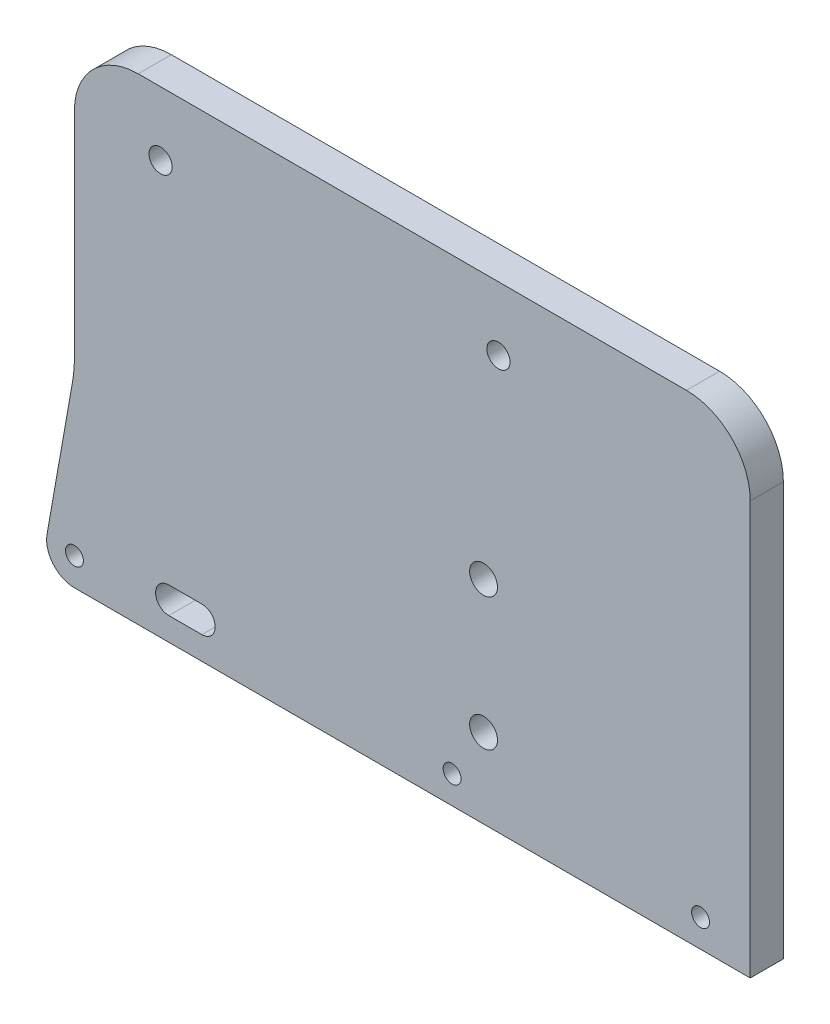
ISO-10303-21;
HEADER;
FILE_DESCRIPTION(('STEP AP214'),'2;1');
FILE_NAME('part.step','',(''),(''),'','','');
FILE_SCHEMA(('AUTOMOTIVE_DESIGN { 1 0 10303 214 1 1 1 1 }'));
ENDSEC;
DATA;
#1=APPLICATION_CONTEXT('core data for automotive mechanical design processes');
#2=APPLICATION_PROTOCOL_DEFINITION('international standard','automotive_design',2000,#1);
#3=PRODUCT_CONTEXT('',#1,'mechanical');
#4=PRODUCT('Part','Part','',(#3));
#5=PRODUCT_RELATED_PRODUCT_CATEGORY('part','',(#4));
#6=PRODUCT_DEFINITION_FORMATION('','',#4);
#7=PRODUCT_DEFINITION_CONTEXT('part definition',#1,'design');
#8=PRODUCT_DEFINITION('design','',#6,#7);
#9=PRODUCT_DEFINITION_SHAPE('','',#8);
#10=(LENGTH_UNIT() NAMED_UNIT(*) SI_UNIT(.MILLI.,.METRE.));
#11=(NAMED_UNIT(*) PLANE_ANGLE_UNIT() SI_UNIT($,.RADIAN.));
#12=(NAMED_UNIT(*) SI_UNIT($,.STERADIAN.) SOLID_ANGLE_UNIT());
#13=UNCERTAINTY_MEASURE_WITH_UNIT(LENGTH_MEASURE(1.E-05),#10,'distance_accuracy_value','');
#14=(GEOMETRIC_REPRESENTATION_CONTEXT(3) GLOBAL_UNCERTAINTY_ASSIGNED_CONTEXT((#13)) GLOBAL_UNIT_ASSIGNED_CONTEXT((#10,
#11,#12)) REPRESENTATION_CONTEXT('',''));
#15=CARTESIAN_POINT('',(0.,0.,0.));
#16=DIRECTION('',(0.,0.,1.));
#17=DIRECTION('',(1.,0.,0.));
#18=AXIS2_PLACEMENT_3D('',#15,#16,#17);
#19=CARTESIAN_POINT('',(30.62,50.37,5.));
#20=DIRECTION('',(0.,0.,1.));
#21=DIRECTION('',(1.,0.,0.));
#22=AXIS2_PLACEMENT_3D('',#19,#20,#21);
#23=PLANE('',#22);
#24=CARTESIAN_POINT('',(0.,20.,5.));
#25=DIRECTION('',(0.,0.,1.));
#26=DIRECTION('',(1.,0.,0.));
#27=AXIS2_PLACEMENT_3D('',#24,#25,#26);
#28=CIRCLE('',#27,2.1);
#29=CARTESIAN_POINT('',(2.1,20.,5.));
#30=VERTEX_POINT('',#29);
#31=EDGE_CURVE('E169',#30,#30,#28,.T.);
#32=ORIENTED_EDGE('',*,*,#31,.F.);
#33=EDGE_LOOP('',(#32));
#34=FACE_BOUND('',#33,.T.);
#35=CARTESIAN_POINT('',(-61.75,-7.8,5.));
#36=DIRECTION('',(0.,0.,1.));
#37=DIRECTION('',(1.,0.,0.));
#38=AXIS2_PLACEMENT_3D('',#35,#36,#37);
#39=CIRCLE('',#38,1.35);
#40=CARTESIAN_POINT('',(-60.4,-7.8,5.));
#41=VERTEX_POINT('',#40);
#42=EDGE_CURVE('E181',#41,#41,#39,.T.);
#43=ORIENTED_EDGE('',*,*,#42,.F.);
#44=EDGE_LOOP('',(#43));
#45=FACE_BOUND('',#44,.T.);
#46=CARTESIAN_POINT('',(2.25,50.37,5.));
#47=DIRECTION('',(0.,0.,1.));
#48=DIRECTION('',(-1.,0.,0.));
#49=AXIS2_PLACEMENT_3D('',#46,#47,#48);
#50=CIRCLE('',#49,1.75);
#51=CARTESIAN_POINT('',(0.499999999999995,50.37,5.));
#52=VERTEX_POINT('',#51);
#53=EDGE_CURVE('E193',#52,#52,#50,.T.);
#54=ORIENTED_EDGE('',*,*,#53,.F.);
#55=EDGE_LOOP('',(#54));
#56=FACE_BOUND('',#55,.T.);
#57=CARTESIAN_POINT('',(0.,0.,5.));
#58=DIRECTION('',(0.,0.,1.));
#59=DIRECTION('',(1.,0.,0.));
#60=AXIS2_PLACEMENT_3D('',#57,#58,#59);
#61=CIRCLE('',#60,2.1);
#62=CARTESIAN_POINT('',(2.1,0.,5.));
#63=VERTEX_POINT('',#62);
#64=EDGE_CURVE('E205',#63,#63,#61,.T.);
#65=ORIENTED_EDGE('',*,*,#64,.F.);
#66=EDGE_LOOP('',(#65));
#67=FACE_BOUND('',#66,.T.);
#68=CARTESIAN_POINT('',(30.62,50.37,5.));
#69=DIRECTION('',(0.,0.,1.));
#70=DIRECTION('',(1.,0.,0.));
#71=AXIS2_PLACEMENT_3D('',#68,#69,#70);
#72=CIRCLE('',#71,9.63);
#73=CARTESIAN_POINT('',(40.25,50.37,5.));
#74=VERTEX_POINT('',#73);
#75=CARTESIAN_POINT('',(30.62,60.,5.));
#76=VERTEX_POINT('',#75);
#77=EDGE_CURVE('E211',#74,#76,#72,.T.);
#78=ORIENTED_EDGE('',*,*,#77,.T.);
#79=DIRECTION('',(-1.,0.,0.));
#80=VECTOR('',#79,1.);
#81=CARTESIAN_POINT('',(-52.12,60.,5.));
#82=LINE('',#81,#80);
#83=CARTESIAN_POINT('',(-52.12,60.,5.));
#84=VERTEX_POINT('',#83);
#85=EDGE_CURVE('E214',#76,#84,#82,.T.);
#86=ORIENTED_EDGE('',*,*,#85,.T.);
#87=CARTESIAN_POINT('',(-52.12,50.37,5.));
#88=DIRECTION('',(0.,0.,1.));
#89=DIRECTION('',(1.,0.,0.));
#90=AXIS2_PLACEMENT_3D('',#87,#88,#89);
#91=CIRCLE('',#90,9.63);
#92=CARTESIAN_POINT('',(-61.75,50.37,5.));
#93=VERTEX_POINT('',#92);
#94=EDGE_CURVE('E217',#84,#93,#91,.T.);
#95=ORIENTED_EDGE('',*,*,#94,.T.);
#96=DIRECTION('',(0.,-1.,0.));
#97=VECTOR('',#96,1.);
#98=CARTESIAN_POINT('',(-61.75,18.1366092997226,5.));
#99=LINE('',#98,#97);
#100=CARTESIAN_POINT('',(-61.75,18.1366092997226,5.));
#101=VERTEX_POINT('',#100);
#102=EDGE_CURVE('E219',#93,#101,#99,.T.);
#103=ORIENTED_EDGE('',*,*,#102,.T.);
#104=CARTESIAN_POINT('',(-81.75,18.1366092997226,5.));
#105=DIRECTION('',(0.,0.,-1.));
#106=DIRECTION('',(1.,0.,0.));
#107=AXIS2_PLACEMENT_3D('',#104,#105,#106);
#108=CIRCLE('',#107,20.);
#109=CARTESIAN_POINT('',(-62.0538449397558,14.6636457463841,5.));
#110=VERTEX_POINT('',#109);
#111=EDGE_CURVE('E221',#101,#110,#108,.T.);
#112=ORIENTED_EDGE('',*,*,#111,.T.);
#113=DIRECTION('',(-0.173648177666923,-0.984807753012209,0.));
#114=VECTOR('',#113,1.);
#115=CARTESIAN_POINT('',(-62.0538449397558,14.6636457463841,5.));
#116=LINE('',#115,#114);
#117=CARTESIAN_POINT('',(-65.8861925626513,-7.07067765379892,5.));
#118=VERTEX_POINT('',#117);
#119=EDGE_CURVE('E223',#110,#118,#116,.T.);
#120=ORIENTED_EDGE('',*,*,#119,.T.);
#121=CARTESIAN_POINT('',(-61.75,-7.8,5.));
#122=DIRECTION('',(0.,0.,1.));
#123=DIRECTION('',(1.,0.,0.));
#124=AXIS2_PLACEMENT_3D('',#121,#122,#123);
#125=CIRCLE('',#124,4.2);
#126=CARTESIAN_POINT('',(-61.75,-12.,5.));
#127=VERTEX_POINT('',#126);
#128=EDGE_CURVE('E225',#118,#127,#125,.T.);
#129=ORIENTED_EDGE('',*,*,#128,.T.);
#130=DIRECTION('',(1.,0.,0.));
#131=VECTOR('',#130,1.);
#132=CARTESIAN_POINT('',(-61.75,-12.,5.));
#133=LINE('',#132,#131);
#134=CARTESIAN_POINT('',(40.25,-12.,5.));
#135=VERTEX_POINT('',#134);
#136=EDGE_CURVE('E227',#127,#135,#133,.T.);
#137=ORIENTED_EDGE('',*,*,#136,.T.);
#138=DIRECTION('',(0.,1.,0.));
#139=VECTOR('',#138,1.);
#140=CARTESIAN_POINT('',(40.25,-12.,5.));
#141=LINE('',#140,#139);
#142=EDGE_CURVE('E229',#135,#74,#141,.T.);
#143=ORIENTED_EDGE('',*,*,#142,.T.);
#144=EDGE_LOOP('',(#78,#86,#95,#103,#112,#120,#129,#137,#143));
#145=FACE_BOUND('',#144,.T.);
#146=CARTESIAN_POINT('',(-48.75,50.37,5.));
#147=DIRECTION('',(0.,0.,1.));
#148=DIRECTION('',(1.,0.,0.));
#149=AXIS2_PLACEMENT_3D('',#146,#147,#148);
#150=CIRCLE('',#149,1.75);
#151=CARTESIAN_POINT('',(-47.,50.37,5.));
#152=VERTEX_POINT('',#151);
#153=EDGE_CURVE('E199',#152,#152,#150,.T.);
#154=ORIENTED_EDGE('',*,*,#153,.F.);
#155=EDGE_LOOP('',(#154));
#156=FACE_BOUND('',#155,.T.);
#157=CARTESIAN_POINT('',(32.75,-7.8,5.));
#158=DIRECTION('',(0.,0.,1.));
#159=DIRECTION('',(1.,0.,0.));
#160=AXIS2_PLACEMENT_3D('',#157,#158,#159);
#161=CIRCLE('',#160,1.35);
#162=CARTESIAN_POINT('',(34.1,-7.8,5.));
#163=VERTEX_POINT('',#162);
#164=EDGE_CURVE('E187',#163,#163,#161,.T.);
#165=ORIENTED_EDGE('',*,*,#164,.F.);
#166=EDGE_LOOP('',(#165));
#167=FACE_BOUND('',#166,.T.);
#168=CARTESIAN_POINT('',(-4.75,-7.8,5.));
#169=DIRECTION('',(0.,0.,1.));
#170=DIRECTION('',(1.,0.,0.));
#171=AXIS2_PLACEMENT_3D('',#168,#169,#170);
#172=CIRCLE('',#171,1.35);
#173=CARTESIAN_POINT('',(-3.4,-7.8,5.));
#174=VERTEX_POINT('',#173);
#175=EDGE_CURVE('E175',#174,#174,#172,.T.);
#176=ORIENTED_EDGE('',*,*,#175,.F.);
#177=EDGE_LOOP('',(#176));
#178=FACE_BOUND('',#177,.T.);
#179=DIRECTION('',(1.,0.,0.));
#180=VECTOR('',#179,1.);
#181=CARTESIAN_POINT('',(-47.5,-8.5,5.));
#182=LINE('',#181,#180);
#183=CARTESIAN_POINT('',(-47.5,-8.5,5.));
#184=VERTEX_POINT('',#183);
#185=CARTESIAN_POINT('',(-42.5,-8.5,5.));
#186=VERTEX_POINT('',#185);
#187=EDGE_CURVE('E141',#184,#186,#182,.T.);
#188=ORIENTED_EDGE('',*,*,#187,.F.);
#189=CARTESIAN_POINT('',(-47.5,-6.5,5.));
#190=DIRECTION('',(0.,0.,1.));
#191=DIRECTION('',(1.,0.,0.));
#192=AXIS2_PLACEMENT_3D('',#189,#190,#191);
#193=CIRCLE('',#192,2.);
#194=CARTESIAN_POINT('',(-47.5,-4.5,5.));
#195=VERTEX_POINT('',#194);
#196=EDGE_CURVE('E133',#195,#184,#193,.T.);
#197=ORIENTED_EDGE('',*,*,#196,.F.);
#198=DIRECTION('',(-1.,0.,0.));
#199=VECTOR('',#198,1.);
#200=CARTESIAN_POINT('',(-47.5,-4.5,5.));
#201=LINE('',#200,#199);
#202=CARTESIAN_POINT('',(-42.5,-4.5,5.));
#203=VERTEX_POINT('',#202);
#204=EDGE_CURVE('E155',#203,#195,#201,.T.);
#205=ORIENTED_EDGE('',*,*,#204,.F.);
#206=CARTESIAN_POINT('',(-42.5,-6.5,5.));
#207=DIRECTION('',(0.,0.,1.));
#208=DIRECTION('',(1.,0.,0.));
#209=AXIS2_PLACEMENT_3D('',#206,#207,#208);
#210=CIRCLE('',#209,2.);
#211=EDGE_CURVE('E153',#186,#203,#210,.T.);
#212=ORIENTED_EDGE('',*,*,#211,.F.);
#213=EDGE_LOOP('',(#188,#197,#205,#212));
#214=FACE_BOUND('',#213,.T.);
#215=ADVANCED_FACE('F38',(#34,#45,#56,#67,#145,#156,#167,#178,#214),#23,.T.);
#216=CARTESIAN_POINT('',(30.62,50.37,0.));
#217=DIRECTION('',(0.,0.,1.));
#218=DIRECTION('',(1.,0.,0.));
#219=AXIS2_PLACEMENT_3D('',#216,#217,#218);
#220=PLANE('',#219);
#221=CARTESIAN_POINT('',(0.,20.,0.));
#222=DIRECTION('',(0.,0.,1.));
#223=DIRECTION('',(1.,0.,0.));
#224=AXIS2_PLACEMENT_3D('',#221,#222,#223);
#225=CIRCLE('',#224,2.1);
#226=CARTESIAN_POINT('',(2.1,20.,0.));
#227=VERTEX_POINT('',#226);
#228=EDGE_CURVE('E149',#227,#227,#225,.T.);
#229=ORIENTED_EDGE('',*,*,#228,.T.);
#230=EDGE_LOOP('',(#229));
#231=FACE_BOUND('',#230,.T.);
#232=CARTESIAN_POINT('',(-61.75,-7.8,0.));
#233=DIRECTION('',(0.,0.,1.));
#234=DIRECTION('',(1.,0.,0.));
#235=AXIS2_PLACEMENT_3D('',#232,#233,#234);
#236=CIRCLE('',#235,1.35);
#237=CARTESIAN_POINT('',(-60.4,-7.8,0.));
#238=VERTEX_POINT('',#237);
#239=EDGE_CURVE('E178',#238,#238,#236,.T.);
#240=ORIENTED_EDGE('',*,*,#239,.T.);
#241=EDGE_LOOP('',(#240));
#242=FACE_BOUND('',#241,.T.);
#243=CARTESIAN_POINT('',(2.25,50.37,0.));
#244=DIRECTION('',(0.,0.,1.));
#245=DIRECTION('',(-1.,0.,0.));
#246=AXIS2_PLACEMENT_3D('',#243,#244,#245);
#247=CIRCLE('',#246,1.75);
#248=CARTESIAN_POINT('',(0.499999999999995,50.37,0.));
#249=VERTEX_POINT('',#248);
#250=EDGE_CURVE('E190',#249,#249,#247,.T.);
#251=ORIENTED_EDGE('',*,*,#250,.T.);
#252=EDGE_LOOP('',(#251));
#253=FACE_BOUND('',#252,.T.);
#254=CARTESIAN_POINT('',(0.,0.,0.));
#255=DIRECTION('',(0.,0.,1.));
#256=DIRECTION('',(1.,0.,0.));
#257=AXIS2_PLACEMENT_3D('',#254,#255,#256);
#258=CIRCLE('',#257,2.1);
#259=CARTESIAN_POINT('',(2.1,0.,0.));
#260=VERTEX_POINT('',#259);
#261=EDGE_CURVE('E202',#260,#260,#258,.T.);
#262=ORIENTED_EDGE('',*,*,#261,.T.);
#263=EDGE_LOOP('',(#262));
#264=FACE_BOUND('',#263,.T.);
#265=CARTESIAN_POINT('',(30.62,50.37,0.));
#266=DIRECTION('',(0.,0.,1.));
#267=DIRECTION('',(1.,0.,0.));
#268=AXIS2_PLACEMENT_3D('',#265,#266,#267);
#269=CIRCLE('',#268,9.63);
#270=CARTESIAN_POINT('',(40.25,50.37,0.));
#271=VERTEX_POINT('',#270);
#272=CARTESIAN_POINT('',(30.62,60.,0.));
#273=VERTEX_POINT('',#272);
#274=EDGE_CURVE('E208',#271,#273,#269,.T.);
#275=ORIENTED_EDGE('',*,*,#274,.F.);
#276=DIRECTION('',(0.,1.,0.));
#277=VECTOR('',#276,1.);
#278=CARTESIAN_POINT('',(40.25,-12.,0.));
#279=LINE('',#278,#277);
#280=CARTESIAN_POINT('',(40.25,-12.,0.));
#281=VERTEX_POINT('',#280);
#282=EDGE_CURVE('E215',#281,#271,#279,.T.);
#283=ORIENTED_EDGE('',*,*,#282,.F.);
#284=DIRECTION('',(1.,0.,0.));
#285=VECTOR('',#284,1.);
#286=CARTESIAN_POINT('',(-61.75,-12.,0.));
#287=LINE('',#286,#285);
#288=CARTESIAN_POINT('',(-61.75,-12.,0.));
#289=VERTEX_POINT('',#288);
#290=EDGE_CURVE('E246',#289,#281,#287,.T.);
#291=ORIENTED_EDGE('',*,*,#290,.F.);
#292=CARTESIAN_POINT('',(-61.75,-7.8,0.));
#293=DIRECTION('',(0.,0.,1.));
#294=DIRECTION('',(1.,0.,0.));
#295=AXIS2_PLACEMENT_3D('',#292,#293,#294);
#296=CIRCLE('',#295,4.2);
#297=CARTESIAN_POINT('',(-65.8861925626513,-7.07067765379892,0.));
#298=VERTEX_POINT('',#297);
#299=EDGE_CURVE('E244',#298,#289,#296,.T.);
#300=ORIENTED_EDGE('',*,*,#299,.F.);
#301=DIRECTION('',(-0.173648177666923,-0.984807753012209,0.));
#302=VECTOR('',#301,1.);
#303=CARTESIAN_POINT('',(-62.0538449397558,14.6636457463841,0.));
#304=LINE('',#303,#302);
#305=CARTESIAN_POINT('',(-62.0538449397558,14.6636457463841,0.));
#306=VERTEX_POINT('',#305);
#307=EDGE_CURVE('E242',#306,#298,#304,.T.);
#308=ORIENTED_EDGE('',*,*,#307,.F.);
#309=CARTESIAN_POINT('',(-81.75,18.1366092997226,0.));
#310=DIRECTION('',(0.,0.,-1.));
#311=DIRECTION('',(1.,0.,0.));
#312=AXIS2_PLACEMENT_3D('',#309,#310,#311);
#313=CIRCLE('',#312,20.);
#314=CARTESIAN_POINT('',(-61.75,18.1366092997226,0.));
#315=VERTEX_POINT('',#314);
#316=EDGE_CURVE('E240',#315,#306,#313,.T.);
#317=ORIENTED_EDGE('',*,*,#316,.F.);
#318=DIRECTION('',(0.,-1.,0.));
#319=VECTOR('',#318,1.);
#320=CARTESIAN_POINT('',(-61.75,18.1366092997226,0.));
#321=LINE('',#320,#319);
#322=CARTESIAN_POINT('',(-61.75,50.37,0.));
#323=VERTEX_POINT('',#322);
#324=EDGE_CURVE('E238',#323,#315,#321,.T.);
#325=ORIENTED_EDGE('',*,*,#324,.F.);
#326=CARTESIAN_POINT('',(-52.12,50.37,0.));
#327=DIRECTION('',(0.,0.,1.));
#328=DIRECTION('',(1.,0.,0.));
#329=AXIS2_PLACEMENT_3D('',#326,#327,#328);
#330=CIRCLE('',#329,9.63);
#331=CARTESIAN_POINT('',(-52.12,60.,0.));
#332=VERTEX_POINT('',#331);
#333=EDGE_CURVE('E236',#332,#323,#330,.T.);
#334=ORIENTED_EDGE('',*,*,#333,.F.);
#335=DIRECTION('',(-1.,0.,0.));
#336=VECTOR('',#335,1.);
#337=CARTESIAN_POINT('',(-52.12,60.,0.));
#338=LINE('',#337,#336);
#339=EDGE_CURVE('E234',#273,#332,#338,.T.);
#340=ORIENTED_EDGE('',*,*,#339,.F.);
#341=EDGE_LOOP('',(#275,#283,#291,#300,#308,#317,#325,#334,#340));
#342=FACE_BOUND('',#341,.T.);
#343=CARTESIAN_POINT('',(-48.75,50.37,0.));
#344=DIRECTION('',(0.,0.,1.));
#345=DIRECTION('',(1.,0.,0.));
#346=AXIS2_PLACEMENT_3D('',#343,#344,#345);
#347=CIRCLE('',#346,1.75);
#348=CARTESIAN_POINT('',(-47.,50.37,0.));
#349=VERTEX_POINT('',#348);
#350=EDGE_CURVE('E196',#349,#349,#347,.T.);
#351=ORIENTED_EDGE('',*,*,#350,.T.);
#352=EDGE_LOOP('',(#351));
#353=FACE_BOUND('',#352,.T.);
#354=CARTESIAN_POINT('',(32.75,-7.8,0.));
#355=DIRECTION('',(0.,0.,1.));
#356=DIRECTION('',(1.,0.,0.));
#357=AXIS2_PLACEMENT_3D('',#354,#355,#356);
#358=CIRCLE('',#357,1.35);
#359=CARTESIAN_POINT('',(34.1,-7.8,0.));
#360=VERTEX_POINT('',#359);
#361=EDGE_CURVE('E184',#360,#360,#358,.T.);
#362=ORIENTED_EDGE('',*,*,#361,.T.);
#363=EDGE_LOOP('',(#362));
#364=FACE_BOUND('',#363,.T.);
#365=CARTESIAN_POINT('',(-4.75,-7.8,0.));
#366=DIRECTION('',(0.,0.,1.));
#367=DIRECTION('',(1.,0.,0.));
#368=AXIS2_PLACEMENT_3D('',#365,#366,#367);
#369=CIRCLE('',#368,1.35);
#370=CARTESIAN_POINT('',(-3.4,-7.8,0.));
#371=VERTEX_POINT('',#370);
#372=EDGE_CURVE('E172',#371,#371,#369,.T.);
#373=ORIENTED_EDGE('',*,*,#372,.T.);
#374=EDGE_LOOP('',(#373));
#375=FACE_BOUND('',#374,.T.);
#376=CARTESIAN_POINT('',(-47.5,-6.5,0.));
#377=DIRECTION('',(0.,0.,1.));
#378=DIRECTION('',(1.,0.,0.));
#379=AXIS2_PLACEMENT_3D('',#376,#377,#378);
#380=CIRCLE('',#379,2.);
#381=CARTESIAN_POINT('',(-47.5,-4.5,0.));
#382=VERTEX_POINT('',#381);
#383=CARTESIAN_POINT('',(-47.5,-8.5,0.));
#384=VERTEX_POINT('',#383);
#385=EDGE_CURVE('E61',#382,#384,#380,.T.);
#386=ORIENTED_EDGE('',*,*,#385,.T.);
#387=DIRECTION('',(1.,0.,0.));
#388=VECTOR('',#387,1.);
#389=CARTESIAN_POINT('',(-47.5,-8.5,0.));
#390=LINE('',#389,#388);
#391=CARTESIAN_POINT('',(-42.5,-8.5,0.));
#392=VERTEX_POINT('',#391);
#393=EDGE_CURVE('E148',#384,#392,#390,.T.);
#394=ORIENTED_EDGE('',*,*,#393,.T.);
#395=CARTESIAN_POINT('',(-42.5,-6.5,0.));
#396=DIRECTION('',(0.,0.,1.));
#397=DIRECTION('',(1.,0.,0.));
#398=AXIS2_PLACEMENT_3D('',#395,#396,#397);
#399=CIRCLE('',#398,2.);
#400=CARTESIAN_POINT('',(-42.5,-4.5,0.));
#401=VERTEX_POINT('',#400);
#402=EDGE_CURVE('E161',#392,#401,#399,.T.);
#403=ORIENTED_EDGE('',*,*,#402,.T.);
#404=DIRECTION('',(-1.,0.,0.));
#405=VECTOR('',#404,1.);
#406=CARTESIAN_POINT('',(-47.5,-4.5,0.));
#407=LINE('',#406,#405);
#408=EDGE_CURVE('E142',#401,#382,#407,.T.);
#409=ORIENTED_EDGE('',*,*,#408,.T.);
#410=EDGE_LOOP('',(#386,#394,#403,#409));
#411=FACE_BOUND('',#410,.T.);
#412=ADVANCED_FACE('F279',(#231,#242,#253,#264,#342,#353,#364,#375,#411),#220,.F.);
#413=CARTESIAN_POINT('',(30.62,50.37,5.));
#414=DIRECTION('',(0.,0.,-1.));
#415=DIRECTION('',(-1.,0.,0.));
#416=AXIS2_PLACEMENT_3D('',#413,#414,#415);
#417=CYLINDRICAL_SURFACE('',#416,9.63);
#418=ORIENTED_EDGE('',*,*,#274,.T.);
#419=DIRECTION('',(0.,0.,-1.));
#420=VECTOR('',#419,1.);
#421=CARTESIAN_POINT('',(30.62,60.,5.));
#422=LINE('',#421,#420);
#423=EDGE_CURVE('E11',#76,#273,#422,.T.);
#424=ORIENTED_EDGE('',*,*,#423,.F.);
#425=ORIENTED_EDGE('',*,*,#77,.F.);
#426=DIRECTION('',(0.,0.,-1.));
#427=VECTOR('',#426,1.);
#428=CARTESIAN_POINT('',(40.25,50.37,5.));
#429=LINE('',#428,#427);
#430=EDGE_CURVE('E231',#74,#271,#429,.T.);
#431=ORIENTED_EDGE('',*,*,#430,.T.);
#432=EDGE_LOOP('',(#418,#424,#425,#431));
#433=FACE_BOUND('',#432,.T.);
#434=ADVANCED_FACE('F40',(#433),#417,.T.);
#435=CARTESIAN_POINT('',(-52.12,60.,5.));
#436=DIRECTION('',(0.,-1.,0.));
#437=DIRECTION('',(0.,0.,-1.));
#438=AXIS2_PLACEMENT_3D('',#435,#436,#437);
#439=PLANE('',#438);
#440=ORIENTED_EDGE('',*,*,#339,.T.);
#441=DIRECTION('',(0.,0.,-1.));
#442=VECTOR('',#441,1.);
#443=CARTESIAN_POINT('',(-52.12,60.,5.));
#444=LINE('',#443,#442);
#445=EDGE_CURVE('E46',#84,#332,#444,.T.);
#446=ORIENTED_EDGE('',*,*,#445,.F.);
#447=ORIENTED_EDGE('',*,*,#85,.F.);
#448=ORIENTED_EDGE('',*,*,#423,.T.);
#449=EDGE_LOOP('',(#440,#446,#447,#448));
#450=FACE_BOUND('',#449,.T.);
#451=ADVANCED_FACE('F297',(#450),#439,.F.);
#452=CARTESIAN_POINT('',(-52.12,50.37,5.));
#453=DIRECTION('',(0.,0.,-1.));
#454=DIRECTION('',(-1.,0.,0.));
#455=AXIS2_PLACEMENT_3D('',#452,#453,#454);
#456=CYLINDRICAL_SURFACE('',#455,9.63);
#457=ORIENTED_EDGE('',*,*,#333,.T.);
#458=DIRECTION('',(0.,0.,-1.));
#459=VECTOR('',#458,1.);
#460=CARTESIAN_POINT('',(-61.75,50.37,5.));
#461=LINE('',#460,#459);
#462=EDGE_CURVE('E266',#93,#323,#461,.T.);
#463=ORIENTED_EDGE('',*,*,#462,.F.);
#464=ORIENTED_EDGE('',*,*,#94,.F.);
#465=ORIENTED_EDGE('',*,*,#445,.T.);
#466=EDGE_LOOP('',(#457,#463,#464,#465));
#467=FACE_BOUND('',#466,.T.);
#468=ADVANCED_FACE('F273',(#467),#456,.T.);
#469=CARTESIAN_POINT('',(-61.75,18.1366092997226,5.));
#470=DIRECTION('',(1.,0.,0.));
#471=DIRECTION('',(0.,1.,0.));
#472=AXIS2_PLACEMENT_3D('',#469,#470,#471);
#473=PLANE('',#472);
#474=ORIENTED_EDGE('',*,*,#324,.T.);
#475=DIRECTION('',(0.,0.,-1.));
#476=VECTOR('',#475,1.);
#477=CARTESIAN_POINT('',(-61.75,18.1366092997226,5.));
#478=LINE('',#477,#476);
#479=EDGE_CURVE('E263',#101,#315,#478,.T.);
#480=ORIENTED_EDGE('',*,*,#479,.F.);
#481=ORIENTED_EDGE('',*,*,#102,.F.);
#482=ORIENTED_EDGE('',*,*,#462,.T.);
#483=EDGE_LOOP('',(#474,#480,#481,#482));
#484=FACE_BOUND('',#483,.T.);
#485=ADVANCED_FACE('F285',(#484),#473,.F.);
#486=CARTESIAN_POINT('',(-81.75,18.1366092997226,5.));
#487=DIRECTION('',(0.,0.,-1.));
#488=DIRECTION('',(-1.,0.,0.));
#489=AXIS2_PLACEMENT_3D('',#486,#487,#488);
#490=CYLINDRICAL_SURFACE('',#489,20.);
#491=ORIENTED_EDGE('',*,*,#316,.T.);
#492=DIRECTION('',(0.,0.,-1.));
#493=VECTOR('',#492,1.);
#494=CARTESIAN_POINT('',(-62.0538449397558,14.6636457463841,5.));
#495=LINE('',#494,#493);
#496=EDGE_CURVE('E260',#110,#306,#495,.T.);
#497=ORIENTED_EDGE('',*,*,#496,.F.);
#498=ORIENTED_EDGE('',*,*,#111,.F.);
#499=ORIENTED_EDGE('',*,*,#479,.T.);
#500=EDGE_LOOP('',(#491,#497,#498,#499));
#501=FACE_BOUND('',#500,.T.);
#502=ADVANCED_FACE('F289',(#501),#490,.F.);
#503=CARTESIAN_POINT('',(-62.0538449397558,14.6636457463841,5.));
#504=DIRECTION('',(0.984807753012209,-0.173648177666923,0.));
#505=DIRECTION('',(0.173648177666923,0.984807753012209,0.));
#506=AXIS2_PLACEMENT_3D('',#503,#504,#505);
#507=PLANE('',#506);
#508=ORIENTED_EDGE('',*,*,#307,.T.);
#509=DIRECTION('',(0.,0.,-1.));
#510=VECTOR('',#509,1.);
#511=CARTESIAN_POINT('',(-65.8861925626513,-7.07067765379892,5.));
#512=LINE('',#511,#510);
#513=EDGE_CURVE('E257',#118,#298,#512,.T.);
#514=ORIENTED_EDGE('',*,*,#513,.F.);
#515=ORIENTED_EDGE('',*,*,#119,.F.);
#516=ORIENTED_EDGE('',*,*,#496,.T.);
#517=EDGE_LOOP('',(#508,#514,#515,#516));
#518=FACE_BOUND('',#517,.T.);
#519=ADVANCED_FACE('F315',(#518),#507,.F.);
#520=CARTESIAN_POINT('',(-61.75,-7.8,5.));
#521=DIRECTION('',(0.,0.,-1.));
#522=DIRECTION('',(-1.,0.,0.));
#523=AXIS2_PLACEMENT_3D('',#520,#521,#522);
#524=CYLINDRICAL_SURFACE('',#523,4.2);
#525=ORIENTED_EDGE('',*,*,#299,.T.);
#526=DIRECTION('',(0.,0.,-1.));
#527=VECTOR('',#526,1.);
#528=CARTESIAN_POINT('',(-61.75,-12.,5.));
#529=LINE('',#528,#527);
#530=EDGE_CURVE('E254',#127,#289,#529,.T.);
#531=ORIENTED_EDGE('',*,*,#530,.F.);
#532=ORIENTED_EDGE('',*,*,#128,.F.);
#533=ORIENTED_EDGE('',*,*,#513,.T.);
#534=EDGE_LOOP('',(#525,#531,#532,#533));
#535=FACE_BOUND('',#534,.T.);
#536=ADVANCED_FACE('F313',(#535),#524,.T.);
#537=CARTESIAN_POINT('',(-61.75,-12.,5.));
#538=DIRECTION('',(0.,1.,0.));
#539=DIRECTION('',(0.,0.,1.));
#540=AXIS2_PLACEMENT_3D('',#537,#538,#539);
#541=PLANE('',#540);
#542=ORIENTED_EDGE('',*,*,#290,.T.);
#543=DIRECTION('',(0.,0.,-1.));
#544=VECTOR('',#543,1.);
#545=CARTESIAN_POINT('',(40.25,-12.,5.));
#546=LINE('',#545,#544);
#547=EDGE_CURVE('E251',#135,#281,#546,.T.);
#548=ORIENTED_EDGE('',*,*,#547,.F.);
#549=ORIENTED_EDGE('',*,*,#136,.F.);
#550=ORIENTED_EDGE('',*,*,#530,.T.);
#551=EDGE_LOOP('',(#542,#548,#549,#550));
#552=FACE_BOUND('',#551,.T.);
#553=ADVANCED_FACE('F309',(#552),#541,.F.);
#554=CARTESIAN_POINT('',(40.25,-12.,5.));
#555=DIRECTION('',(-1.,0.,0.));
#556=DIRECTION('',(0.,0.,1.));
#557=AXIS2_PLACEMENT_3D('',#554,#555,#556);
#558=PLANE('',#557);
#559=ORIENTED_EDGE('',*,*,#282,.T.);
#560=ORIENTED_EDGE('',*,*,#430,.F.);
#561=ORIENTED_EDGE('',*,*,#142,.F.);
#562=ORIENTED_EDGE('',*,*,#547,.T.);
#563=EDGE_LOOP('',(#559,#560,#561,#562));
#564=FACE_BOUND('',#563,.T.);
#565=ADVANCED_FACE('F304',(#564),#558,.F.);
#566=CARTESIAN_POINT('',(0.,0.,5.));
#567=DIRECTION('',(0.,0.,-1.));
#568=DIRECTION('',(-1.,0.,0.));
#569=AXIS2_PLACEMENT_3D('',#566,#567,#568);
#570=CYLINDRICAL_SURFACE('',#569,2.1);
#571=ORIENTED_EDGE('',*,*,#64,.T.);
#572=EDGE_LOOP('',(#571));
#573=FACE_BOUND('',#572,.T.);
#574=ORIENTED_EDGE('',*,*,#261,.F.);
#575=EDGE_LOOP('',(#574));
#576=FACE_BOUND('',#575,.T.);
#577=ADVANCED_FACE('F335',(#573,#576),#570,.F.);
#578=CARTESIAN_POINT('',(-48.75,50.37,5.));
#579=DIRECTION('',(0.,0.,-1.));
#580=DIRECTION('',(-1.,0.,0.));
#581=AXIS2_PLACEMENT_3D('',#578,#579,#580);
#582=CYLINDRICAL_SURFACE('',#581,1.75);
#583=ORIENTED_EDGE('',*,*,#153,.T.);
#584=EDGE_LOOP('',(#583));
#585=FACE_BOUND('',#584,.T.);
#586=ORIENTED_EDGE('',*,*,#350,.F.);
#587=EDGE_LOOP('',(#586));
#588=FACE_BOUND('',#587,.T.);
#589=ADVANCED_FACE('F355',(#585,#588),#582,.F.);
#590=CARTESIAN_POINT('',(2.25,50.37,5.));
#591=DIRECTION('',(0.,0.,-1.));
#592=DIRECTION('',(-1.,0.,0.));
#593=AXIS2_PLACEMENT_3D('',#590,#591,#592);
#594=CYLINDRICAL_SURFACE('',#593,1.75);
#595=ORIENTED_EDGE('',*,*,#53,.T.);
#596=EDGE_LOOP('',(#595));
#597=FACE_BOUND('',#596,.T.);
#598=ORIENTED_EDGE('',*,*,#250,.F.);
#599=EDGE_LOOP('',(#598));
#600=FACE_BOUND('',#599,.T.);
#601=ADVANCED_FACE('F362',(#597,#600),#594,.F.);
#602=CARTESIAN_POINT('',(32.75,-7.8,5.));
#603=DIRECTION('',(0.,0.,-1.));
#604=DIRECTION('',(-1.,0.,0.));
#605=AXIS2_PLACEMENT_3D('',#602,#603,#604);
#606=CYLINDRICAL_SURFACE('',#605,1.35);
#607=ORIENTED_EDGE('',*,*,#164,.T.);
#608=EDGE_LOOP('',(#607));
#609=FACE_BOUND('',#608,.T.);
#610=ORIENTED_EDGE('',*,*,#361,.F.);
#611=EDGE_LOOP('',(#610));
#612=FACE_BOUND('',#611,.T.);
#613=ADVANCED_FACE('F369',(#609,#612),#606,.F.);
#614=CARTESIAN_POINT('',(-61.75,-7.8,5.));
#615=DIRECTION('',(0.,0.,-1.));
#616=DIRECTION('',(-1.,0.,0.));
#617=AXIS2_PLACEMENT_3D('',#614,#615,#616);
#618=CYLINDRICAL_SURFACE('',#617,1.35);
#619=ORIENTED_EDGE('',*,*,#42,.T.);
#620=EDGE_LOOP('',(#619));
#621=FACE_BOUND('',#620,.T.);
#622=ORIENTED_EDGE('',*,*,#239,.F.);
#623=EDGE_LOOP('',(#622));
#624=FACE_BOUND('',#623,.T.);
#625=ADVANCED_FACE('F377',(#621,#624),#618,.F.);
#626=CARTESIAN_POINT('',(-4.75,-7.8,5.));
#627=DIRECTION('',(0.,0.,-1.));
#628=DIRECTION('',(-1.,0.,0.));
#629=AXIS2_PLACEMENT_3D('',#626,#627,#628);
#630=CYLINDRICAL_SURFACE('',#629,1.35);
#631=ORIENTED_EDGE('',*,*,#175,.T.);
#632=EDGE_LOOP('',(#631));
#633=FACE_BOUND('',#632,.T.);
#634=ORIENTED_EDGE('',*,*,#372,.F.);
#635=EDGE_LOOP('',(#634));
#636=FACE_BOUND('',#635,.T.);
#637=ADVANCED_FACE('F385',(#633,#636),#630,.F.);
#638=CARTESIAN_POINT('',(0.,20.,5.));
#639=DIRECTION('',(0.,0.,-1.));
#640=DIRECTION('',(-1.,0.,0.));
#641=AXIS2_PLACEMENT_3D('',#638,#639,#640);
#642=CYLINDRICAL_SURFACE('',#641,2.1);
#643=ORIENTED_EDGE('',*,*,#31,.T.);
#644=EDGE_LOOP('',(#643));
#645=FACE_BOUND('',#644,.T.);
#646=ORIENTED_EDGE('',*,*,#228,.F.);
#647=EDGE_LOOP('',(#646));
#648=FACE_BOUND('',#647,.T.);
#649=ADVANCED_FACE('F393',(#645,#648),#642,.F.);
#650=CARTESIAN_POINT('',(-47.5,-6.5,5.));
#651=DIRECTION('',(0.,0.,-1.));
#652=DIRECTION('',(-1.,0.,0.));
#653=AXIS2_PLACEMENT_3D('',#650,#651,#652);
#654=CYLINDRICAL_SURFACE('',#653,2.);
#655=ORIENTED_EDGE('',*,*,#385,.F.);
#656=DIRECTION('',(0.,0.,-1.));
#657=VECTOR('',#656,1.);
#658=CARTESIAN_POINT('',(-47.5,-4.5,5.));
#659=LINE('',#658,#657);
#660=EDGE_CURVE('E137',#195,#382,#659,.T.);
#661=ORIENTED_EDGE('',*,*,#660,.F.);
#662=ORIENTED_EDGE('',*,*,#196,.T.);
#663=DIRECTION('',(0.,0.,-1.));
#664=VECTOR('',#663,1.);
#665=CARTESIAN_POINT('',(-47.5,-8.5,5.));
#666=LINE('',#665,#664);
#667=EDGE_CURVE('E136',#184,#384,#666,.T.);
#668=ORIENTED_EDGE('',*,*,#667,.T.);
#669=EDGE_LOOP('',(#655,#661,#662,#668));
#670=FACE_BOUND('',#669,.T.);
#671=ADVANCED_FACE('F135',(#670),#654,.F.);
#672=CARTESIAN_POINT('',(-47.5,-8.5,5.));
#673=DIRECTION('',(0.,1.,0.));
#674=DIRECTION('',(0.,0.,1.));
#675=AXIS2_PLACEMENT_3D('',#672,#673,#674);
#676=PLANE('',#675);
#677=ORIENTED_EDGE('',*,*,#393,.F.);
#678=ORIENTED_EDGE('',*,*,#667,.F.);
#679=ORIENTED_EDGE('',*,*,#187,.T.);
#680=DIRECTION('',(0.,0.,-1.));
#681=VECTOR('',#680,1.);
#682=CARTESIAN_POINT('',(-42.5,-8.5,5.));
#683=LINE('',#682,#681);
#684=EDGE_CURVE('E150',#186,#392,#683,.T.);
#685=ORIENTED_EDGE('',*,*,#684,.T.);
#686=EDGE_LOOP('',(#677,#678,#679,#685));
#687=FACE_BOUND('',#686,.T.);
#688=ADVANCED_FACE('F145',(#687),#676,.T.);
#689=CARTESIAN_POINT('',(-42.5,-6.5,5.));
#690=DIRECTION('',(0.,0.,-1.));
#691=DIRECTION('',(-1.,0.,0.));
#692=AXIS2_PLACEMENT_3D('',#689,#690,#691);
#693=CYLINDRICAL_SURFACE('',#692,2.);
#694=ORIENTED_EDGE('',*,*,#402,.F.);
#695=ORIENTED_EDGE('',*,*,#684,.F.);
#696=ORIENTED_EDGE('',*,*,#211,.T.);
#697=DIRECTION('',(0.,0.,-1.));
#698=VECTOR('',#697,1.);
#699=CARTESIAN_POINT('',(-42.5,-4.5,5.));
#700=LINE('',#699,#698);
#701=EDGE_CURVE('E53',#203,#401,#700,.T.);
#702=ORIENTED_EDGE('',*,*,#701,.T.);
#703=EDGE_LOOP('',(#694,#695,#696,#702));
#704=FACE_BOUND('',#703,.T.);
#705=ADVANCED_FACE('F414',(#704),#693,.F.);
#706=CARTESIAN_POINT('',(-47.5,-4.5,5.));
#707=DIRECTION('',(0.,-1.,0.));
#708=DIRECTION('',(1.,0.,0.));
#709=AXIS2_PLACEMENT_3D('',#706,#707,#708);
#710=PLANE('',#709);
#711=ORIENTED_EDGE('',*,*,#408,.F.);
#712=ORIENTED_EDGE('',*,*,#701,.F.);
#713=ORIENTED_EDGE('',*,*,#204,.T.);
#714=ORIENTED_EDGE('',*,*,#660,.T.);
#715=EDGE_LOOP('',(#711,#712,#713,#714));
#716=FACE_BOUND('',#715,.T.);
#717=ADVANCED_FACE('F421',(#716),#710,.T.);
#718=CLOSED_SHELL('',(#215,#412,#434,#451,#468,#485,#502,#519,#536,#553,#565,#577,#589,#601,
#613,#625,#637,#649,#671,#688,#705,#717));
#719=MANIFOLD_SOLID_BREP('B2',#718);
#720=ADVANCED_BREP_SHAPE_REPRESENTATION('',(#18,#719),#14);
#721=SHAPE_DEFINITION_REPRESENTATION(#9,#720);
ENDSEC;
END-ISO-10303-21;
